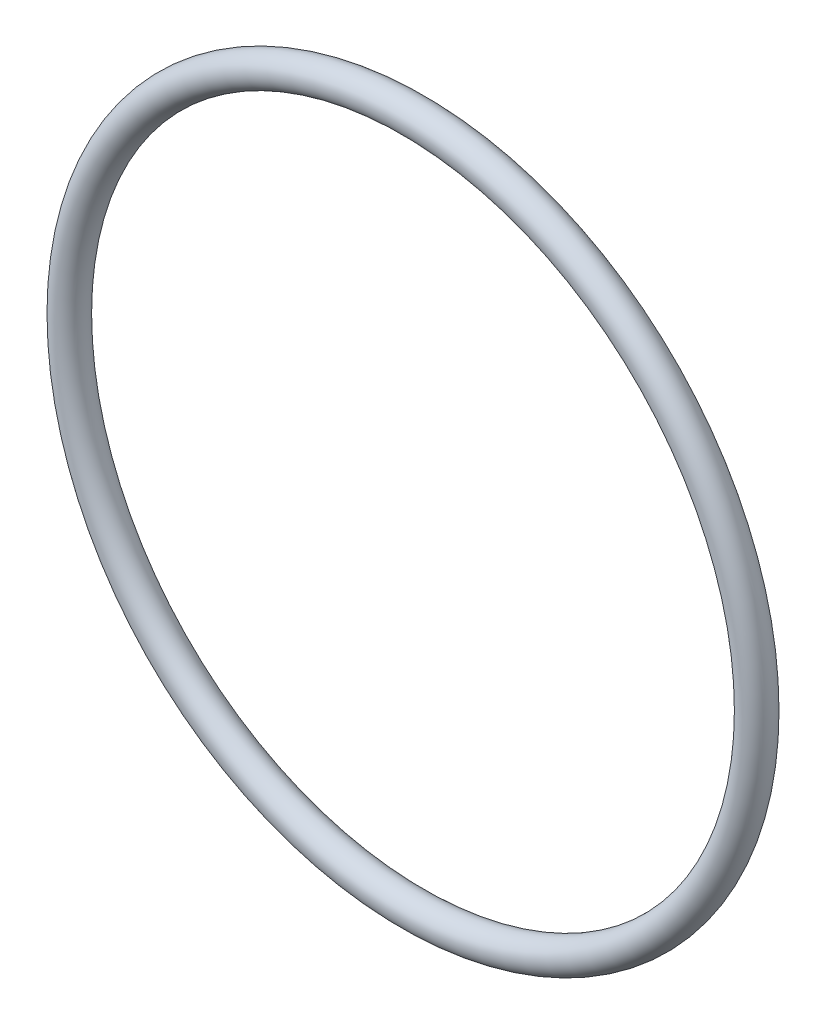
ISO-10303-21;
HEADER;
FILE_DESCRIPTION(('STEP AP214'),'2;1');
FILE_NAME('part.step','',(''),(''),'','','');
FILE_SCHEMA(('AUTOMOTIVE_DESIGN { 1 0 10303 214 1 1 1 1 }'));
ENDSEC;
DATA;
#1=APPLICATION_CONTEXT('core data for automotive mechanical design processes');
#2=APPLICATION_PROTOCOL_DEFINITION('international standard','automotive_design',2000,#1);
#3=PRODUCT_CONTEXT('',#1,'mechanical');
#4=PRODUCT('Part','Part','',(#3));
#5=PRODUCT_RELATED_PRODUCT_CATEGORY('part','',(#4));
#6=PRODUCT_DEFINITION_FORMATION('','',#4);
#7=PRODUCT_DEFINITION_CONTEXT('part definition',#1,'design');
#8=PRODUCT_DEFINITION('design','',#6,#7);
#9=PRODUCT_DEFINITION_SHAPE('','',#8);
#10=(LENGTH_UNIT() NAMED_UNIT(*) SI_UNIT(.MILLI.,.METRE.));
#11=(NAMED_UNIT(*) PLANE_ANGLE_UNIT() SI_UNIT($,.RADIAN.));
#12=(NAMED_UNIT(*) SI_UNIT($,.STERADIAN.) SOLID_ANGLE_UNIT());
#13=UNCERTAINTY_MEASURE_WITH_UNIT(LENGTH_MEASURE(1.E-05),#10,'distance_accuracy_value','');
#14=(GEOMETRIC_REPRESENTATION_CONTEXT(3) GLOBAL_UNCERTAINTY_ASSIGNED_CONTEXT((#13)) GLOBAL_UNIT_ASSIGNED_CONTEXT((#10,
#11,#12)) REPRESENTATION_CONTEXT('',''));
#15=CARTESIAN_POINT('',(0.,0.,0.));
#16=DIRECTION('',(0.,0.,1.));
#17=DIRECTION('',(1.,0.,0.));
#18=AXIS2_PLACEMENT_3D('',#15,#16,#17);
#19=CARTESIAN_POINT('',(0.,0.,0.));
#20=DIRECTION('',(0.,0.,-1.));
#21=DIRECTION('',(-1.,0.,0.));
#22=AXIS2_PLACEMENT_3D('',#19,#20,#21);
#23=TOROIDAL_SURFACE('',#22,33.75,1.55);
#24=CARTESIAN_POINT('',(-35.3,0.,0.));
#25=VERTEX_POINT('',#24);
#26=VERTEX_LOOP('',#25);
#27=FACE_BOUND('',#26,.T.);
#28=ADVANCED_FACE('F29',(#27),#23,.T.);
#29=CLOSED_SHELL('',(#28));
#30=MANIFOLD_SOLID_BREP('B2',#29);
#31=ADVANCED_BREP_SHAPE_REPRESENTATION('',(#18,#30),#14);
#32=SHAPE_DEFINITION_REPRESENTATION(#9,#31);
ENDSEC;
END-ISO-10303-21;
